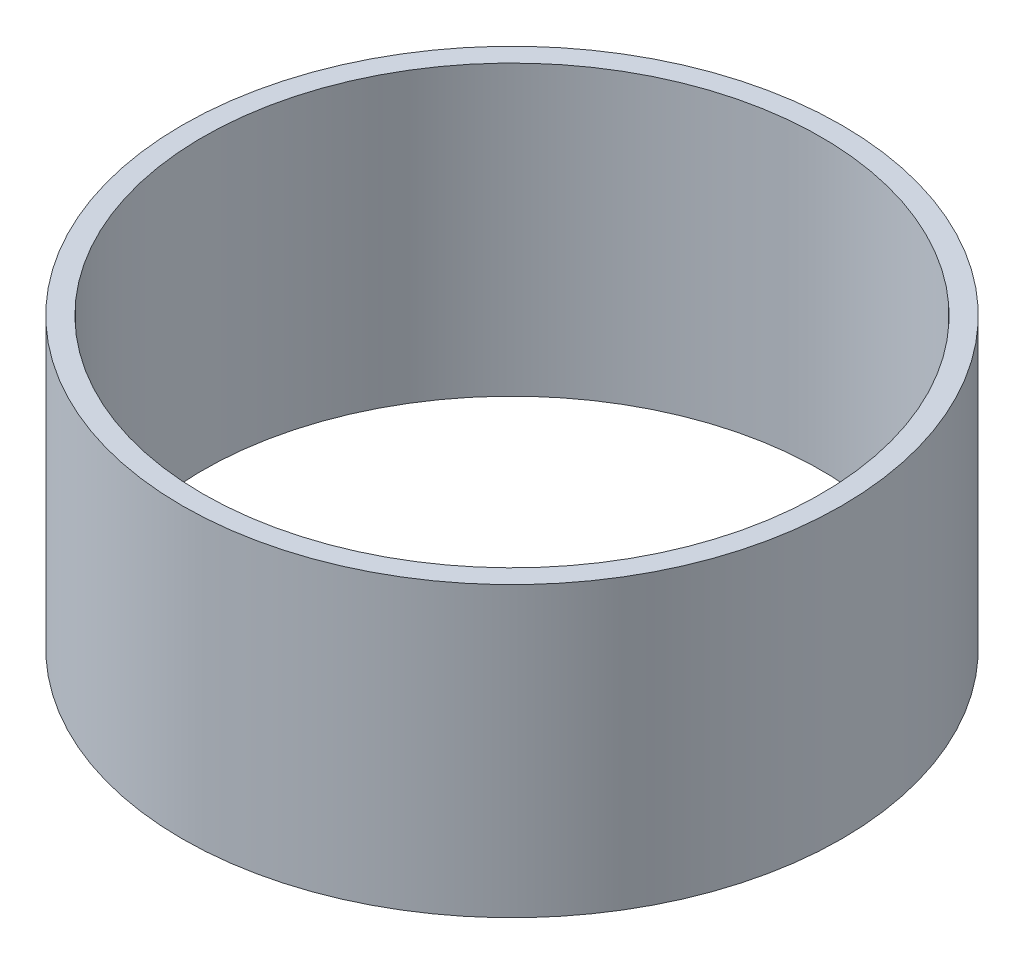
ISO-10303-21;
HEADER;
FILE_DESCRIPTION(('STEP AP214'),'2;1');
FILE_NAME('part.step','',(''),(''),'','','');
FILE_SCHEMA(('AUTOMOTIVE_DESIGN { 1 0 10303 214 1 1 1 1 }'));
ENDSEC;
DATA;
#1=APPLICATION_CONTEXT('core data for automotive mechanical design processes');
#2=APPLICATION_PROTOCOL_DEFINITION('international standard','automotive_design',2000,#1);
#3=PRODUCT_CONTEXT('',#1,'mechanical');
#4=PRODUCT('Part','Part','',(#3));
#5=PRODUCT_RELATED_PRODUCT_CATEGORY('part','',(#4));
#6=PRODUCT_DEFINITION_FORMATION('','',#4);
#7=PRODUCT_DEFINITION_CONTEXT('part definition',#1,'design');
#8=PRODUCT_DEFINITION('design','',#6,#7);
#9=PRODUCT_DEFINITION_SHAPE('','',#8);
#10=(LENGTH_UNIT() NAMED_UNIT(*) SI_UNIT(.MILLI.,.METRE.));
#11=(NAMED_UNIT(*) PLANE_ANGLE_UNIT() SI_UNIT($,.RADIAN.));
#12=(NAMED_UNIT(*) SI_UNIT($,.STERADIAN.) SOLID_ANGLE_UNIT());
#13=UNCERTAINTY_MEASURE_WITH_UNIT(LENGTH_MEASURE(1.E-05),#10,'distance_accuracy_value','');
#14=(GEOMETRIC_REPRESENTATION_CONTEXT(3) GLOBAL_UNCERTAINTY_ASSIGNED_CONTEXT((#13)) GLOBAL_UNIT_ASSIGNED_CONTEXT((#10,
#11,#12)) REPRESENTATION_CONTEXT('',''));
#15=CARTESIAN_POINT('',(0.,0.,0.));
#16=DIRECTION('',(0.,0.,1.));
#17=DIRECTION('',(1.,0.,0.));
#18=AXIS2_PLACEMENT_3D('',#15,#16,#17);
#19=CARTESIAN_POINT('',(0.,28.,0.));
#20=DIRECTION('',(0.,1.,0.));
#21=DIRECTION('',(0.,0.,1.));
#22=AXIS2_PLACEMENT_3D('',#19,#20,#21);
#23=PLANE('',#22);
#24=CARTESIAN_POINT('',(0.,28.,0.));
#25=DIRECTION('',(0.,1.,0.));
#26=DIRECTION('',(1.,0.,0.));
#27=AXIS2_PLACEMENT_3D('',#24,#25,#26);
#28=CIRCLE('',#27,32.);
#29=CARTESIAN_POINT('',(32.0000000000001,28.,0.));
#30=VERTEX_POINT('',#29);
#31=EDGE_CURVE('E11',#30,#30,#28,.T.);
#32=ORIENTED_EDGE('',*,*,#31,.T.);
#33=EDGE_LOOP('',(#32));
#34=FACE_BOUND('',#33,.T.);
#35=CARTESIAN_POINT('',(0.,28.,0.));
#36=DIRECTION('',(0.,1.,0.));
#37=DIRECTION('',(0.,0.,1.));
#38=AXIS2_PLACEMENT_3D('',#35,#36,#37);
#39=CIRCLE('',#38,30.);
#40=CARTESIAN_POINT('',(0.,28.,30.0000000000001));
#41=VERTEX_POINT('',#40);
#42=EDGE_CURVE('E56',#41,#41,#39,.T.);
#43=ORIENTED_EDGE('',*,*,#42,.F.);
#44=EDGE_LOOP('',(#43));
#45=FACE_BOUND('',#44,.T.);
#46=ADVANCED_FACE('F42',(#34,#45),#23,.T.);
#47=CARTESIAN_POINT('',(0.,0.,0.));
#48=DIRECTION('',(0.,1.,0.));
#49=DIRECTION('',(0.,0.,1.));
#50=AXIS2_PLACEMENT_3D('',#47,#48,#49);
#51=PLANE('',#50);
#52=CARTESIAN_POINT('',(0.,0.,0.));
#53=DIRECTION('',(0.,1.,0.));
#54=DIRECTION('',(1.,0.,0.));
#55=AXIS2_PLACEMENT_3D('',#52,#53,#54);
#56=CIRCLE('',#55,32.);
#57=CARTESIAN_POINT('',(32.0000000000001,0.,0.));
#58=VERTEX_POINT('',#57);
#59=EDGE_CURVE('E46',#58,#58,#56,.T.);
#60=ORIENTED_EDGE('',*,*,#59,.F.);
#61=EDGE_LOOP('',(#60));
#62=FACE_BOUND('',#61,.T.);
#63=CARTESIAN_POINT('',(0.,0.,0.));
#64=DIRECTION('',(0.,1.,0.));
#65=DIRECTION('',(0.,0.,1.));
#66=AXIS2_PLACEMENT_3D('',#63,#64,#65);
#67=CIRCLE('',#66,30.);
#68=CARTESIAN_POINT('',(0.,0.,30.0000000000001));
#69=VERTEX_POINT('',#68);
#70=EDGE_CURVE('E58',#69,#69,#67,.T.);
#71=ORIENTED_EDGE('',*,*,#70,.T.);
#72=EDGE_LOOP('',(#71));
#73=FACE_BOUND('',#72,.T.);
#74=ADVANCED_FACE('F71',(#62,#73),#51,.F.);
#75=CARTESIAN_POINT('',(0.,28.,0.));
#76=DIRECTION('',(0.,-1.,0.));
#77=DIRECTION('',(0.,0.,-1.));
#78=AXIS2_PLACEMENT_3D('',#75,#76,#77);
#79=CYLINDRICAL_SURFACE('',#78,32.);
#80=ORIENTED_EDGE('',*,*,#31,.F.);
#81=EDGE_LOOP('',(#80));
#82=FACE_BOUND('',#81,.T.);
#83=ORIENTED_EDGE('',*,*,#59,.T.);
#84=EDGE_LOOP('',(#83));
#85=FACE_BOUND('',#84,.T.);
#86=ADVANCED_FACE('F44',(#82,#85),#79,.T.);
#87=CARTESIAN_POINT('',(0.,28.,0.));
#88=DIRECTION('',(0.,-1.,0.));
#89=DIRECTION('',(0.,0.,-1.));
#90=AXIS2_PLACEMENT_3D('',#87,#88,#89);
#91=CYLINDRICAL_SURFACE('',#90,30.);
#92=ORIENTED_EDGE('',*,*,#42,.T.);
#93=EDGE_LOOP('',(#92));
#94=FACE_BOUND('',#93,.T.);
#95=ORIENTED_EDGE('',*,*,#70,.F.);
#96=EDGE_LOOP('',(#95));
#97=FACE_BOUND('',#96,.T.);
#98=ADVANCED_FACE('F67',(#94,#97),#91,.F.);
#99=CLOSED_SHELL('',(#46,#74,#86,#98));
#100=MANIFOLD_SOLID_BREP('B2',#99);
#101=ADVANCED_BREP_SHAPE_REPRESENTATION('',(#18,#100),#14);
#102=SHAPE_DEFINITION_REPRESENTATION(#9,#101);
ENDSEC;
END-ISO-10303-21;
